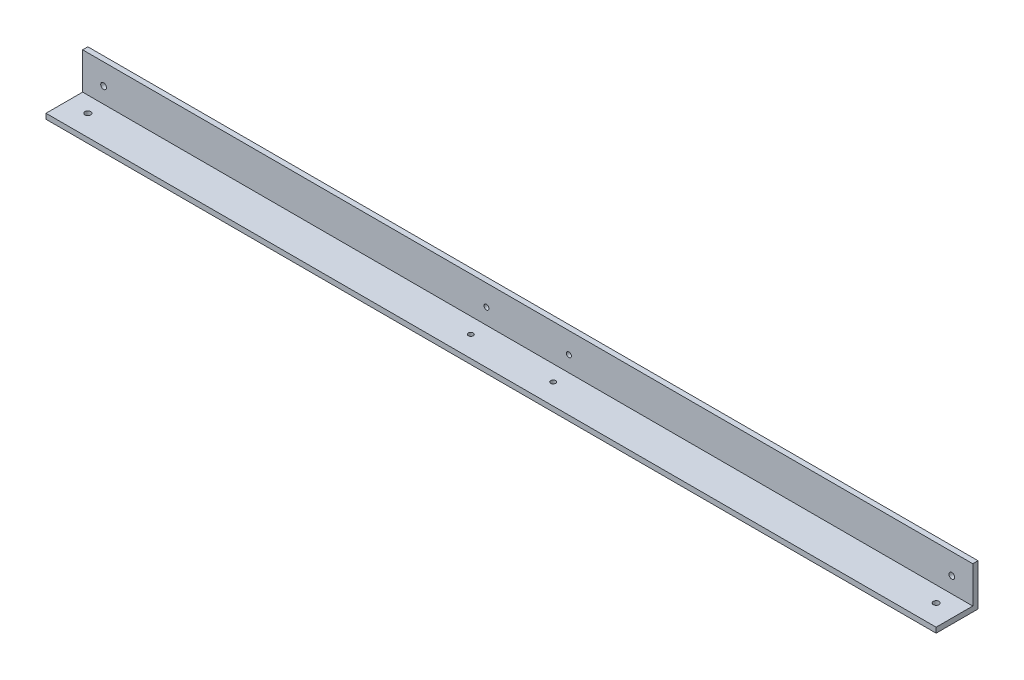
ISO-10303-21;
HEADER;
FILE_DESCRIPTION(('STEP AP214'),'2;1');
FILE_NAME('part.step','',(''),(''),'','','');
FILE_SCHEMA(('AUTOMOTIVE_DESIGN { 1 0 10303 214 1 1 1 1 }'));
ENDSEC;
DATA;
#1=APPLICATION_CONTEXT('core data for automotive mechanical design processes');
#2=APPLICATION_PROTOCOL_DEFINITION('international standard','automotive_design',2000,#1);
#3=PRODUCT_CONTEXT('',#1,'mechanical');
#4=PRODUCT('Part','Part','',(#3));
#5=PRODUCT_RELATED_PRODUCT_CATEGORY('part','',(#4));
#6=PRODUCT_DEFINITION_FORMATION('','',#4);
#7=PRODUCT_DEFINITION_CONTEXT('part definition',#1,'design');
#8=PRODUCT_DEFINITION('design','',#6,#7);
#9=PRODUCT_DEFINITION_SHAPE('','',#8);
#10=(LENGTH_UNIT() NAMED_UNIT(*) SI_UNIT(.MILLI.,.METRE.));
#11=(NAMED_UNIT(*) PLANE_ANGLE_UNIT() SI_UNIT($,.RADIAN.));
#12=(NAMED_UNIT(*) SI_UNIT($,.STERADIAN.) SOLID_ANGLE_UNIT());
#13=UNCERTAINTY_MEASURE_WITH_UNIT(LENGTH_MEASURE(1.E-05),#10,'distance_accuracy_value','');
#14=(GEOMETRIC_REPRESENTATION_CONTEXT(3) GLOBAL_UNCERTAINTY_ASSIGNED_CONTEXT((#13)) GLOBAL_UNIT_ASSIGNED_CONTEXT((#10,
#11,#12)) REPRESENTATION_CONTEXT('',''));
#15=CARTESIAN_POINT('',(0.,0.,0.));
#16=DIRECTION('',(0.,0.,1.));
#17=DIRECTION('',(1.,0.,0.));
#18=AXIS2_PLACEMENT_3D('',#15,#16,#17);
#19=CARTESIAN_POINT('',(-270.,25.4,3.175));
#20=DIRECTION('',(0.,1.,0.));
#21=DIRECTION('',(0.,0.,1.));
#22=AXIS2_PLACEMENT_3D('',#19,#20,#21);
#23=PLANE('',#22);
#24=DIRECTION('',(1.,0.,0.));
#25=VECTOR('',#24,1.);
#26=CARTESIAN_POINT('',(-270.,25.4,3.175));
#27=LINE('',#26,#25);
#28=CARTESIAN_POINT('',(-270.,25.4,3.175));
#29=VERTEX_POINT('',#28);
#30=CARTESIAN_POINT('',(270.,25.4,3.175));
#31=VERTEX_POINT('',#30);
#32=EDGE_CURVE('E38',#29,#31,#27,.T.);
#33=ORIENTED_EDGE('',*,*,#32,.T.);
#34=DIRECTION('',(0.,0.,1.));
#35=VECTOR('',#34,1.);
#36=CARTESIAN_POINT('',(270.,25.4,3.175));
#37=LINE('',#36,#35);
#38=CARTESIAN_POINT('',(270.,25.4,0.));
#39=VERTEX_POINT('',#38);
#40=EDGE_CURVE('E87',#39,#31,#37,.T.);
#41=ORIENTED_EDGE('',*,*,#40,.F.);
#42=DIRECTION('',(1.,0.,0.));
#43=VECTOR('',#42,1.);
#44=CARTESIAN_POINT('',(-270.,25.4,0.));
#45=LINE('',#44,#43);
#46=CARTESIAN_POINT('',(-270.,25.4,0.));
#47=VERTEX_POINT('',#46);
#48=EDGE_CURVE('E11',#47,#39,#45,.T.);
#49=ORIENTED_EDGE('',*,*,#48,.F.);
#50=DIRECTION('',(0.,0.,1.));
#51=VECTOR('',#50,1.);
#52=CARTESIAN_POINT('',(-270.,25.4,3.175));
#53=LINE('',#52,#51);
#54=EDGE_CURVE('E88',#47,#29,#53,.T.);
#55=ORIENTED_EDGE('',*,*,#54,.T.);
#56=EDGE_LOOP('',(#33,#41,#49,#55));
#57=FACE_BOUND('',#56,.T.);
#58=ADVANCED_FACE('F35',(#57),#23,.T.);
#59=CARTESIAN_POINT('',(-270.,25.4,0.));
#60=DIRECTION('',(0.,0.,-1.));
#61=DIRECTION('',(-1.,0.,0.));
#62=AXIS2_PLACEMENT_3D('',#59,#60,#61);
#63=PLANE('',#62);
#64=CARTESIAN_POINT('',(-257.3,12.7,0.));
#65=DIRECTION('',(0.,0.,-1.));
#66=DIRECTION('',(1.,0.,0.));
#67=AXIS2_PLACEMENT_3D('',#64,#65,#66);
#68=CIRCLE('',#67,1.74999999999998);
#69=CARTESIAN_POINT('',(-255.55,12.7,0.));
#70=VERTEX_POINT('',#69);
#71=EDGE_CURVE('E267',#70,#70,#68,.T.);
#72=ORIENTED_EDGE('',*,*,#71,.F.);
#73=EDGE_LOOP('',(#72));
#74=FACE_BOUND('',#73,.T.);
#75=CARTESIAN_POINT('',(257.3,12.7,0.));
#76=DIRECTION('',(0.,0.,-1.));
#77=DIRECTION('',(-1.,0.,0.));
#78=AXIS2_PLACEMENT_3D('',#75,#76,#77);
#79=CIRCLE('',#78,1.74999999999998);
#80=CARTESIAN_POINT('',(255.55,12.7,0.));
#81=VERTEX_POINT('',#80);
#82=EDGE_CURVE('E263',#81,#81,#79,.T.);
#83=ORIENTED_EDGE('',*,*,#82,.F.);
#84=EDGE_LOOP('',(#83));
#85=FACE_BOUND('',#84,.T.);
#86=CARTESIAN_POINT('',(25.,12.7,0.));
#87=DIRECTION('',(0.,0.,-1.));
#88=DIRECTION('',(-1.,0.,0.));
#89=AXIS2_PLACEMENT_3D('',#86,#87,#88);
#90=CIRCLE('',#89,1.5);
#91=CARTESIAN_POINT('',(23.5,12.7,0.));
#92=VERTEX_POINT('',#91);
#93=EDGE_CURVE('E259',#92,#92,#90,.T.);
#94=ORIENTED_EDGE('',*,*,#93,.F.);
#95=EDGE_LOOP('',(#94));
#96=FACE_BOUND('',#95,.T.);
#97=CARTESIAN_POINT('',(-25.,12.7000000000001,0.));
#98=DIRECTION('',(0.,0.,-1.));
#99=DIRECTION('',(-1.,0.,0.));
#100=AXIS2_PLACEMENT_3D('',#97,#98,#99);
#101=CIRCLE('',#100,1.5);
#102=CARTESIAN_POINT('',(-26.5,12.7000000000001,0.));
#103=VERTEX_POINT('',#102);
#104=EDGE_CURVE('E191',#103,#103,#101,.T.);
#105=ORIENTED_EDGE('',*,*,#104,.F.);
#106=EDGE_LOOP('',(#105));
#107=FACE_BOUND('',#106,.T.);
#108=ORIENTED_EDGE('',*,*,#48,.T.);
#109=DIRECTION('',(0.,1.,0.));
#110=VECTOR('',#109,1.);
#111=CARTESIAN_POINT('',(270.,25.4,0.));
#112=LINE('',#111,#110);
#113=CARTESIAN_POINT('',(270.,0.,0.));
#114=VERTEX_POINT('',#113);
#115=EDGE_CURVE('E105',#114,#39,#112,.T.);
#116=ORIENTED_EDGE('',*,*,#115,.F.);
#117=DIRECTION('',(1.,0.,0.));
#118=VECTOR('',#117,1.);
#119=CARTESIAN_POINT('',(-270.,0.,0.));
#120=LINE('',#119,#118);
#121=CARTESIAN_POINT('',(-270.,0.,0.));
#122=VERTEX_POINT('',#121);
#123=EDGE_CURVE('E43',#122,#114,#120,.T.);
#124=ORIENTED_EDGE('',*,*,#123,.F.);
#125=DIRECTION('',(0.,1.,0.));
#126=VECTOR('',#125,1.);
#127=CARTESIAN_POINT('',(-270.,25.4,0.));
#128=LINE('',#127,#126);
#129=EDGE_CURVE('E93',#122,#47,#128,.T.);
#130=ORIENTED_EDGE('',*,*,#129,.T.);
#131=EDGE_LOOP('',(#108,#116,#124,#130));
#132=FACE_BOUND('',#131,.T.);
#133=ADVANCED_FACE('F150',(#74,#85,#96,#107,#132),#63,.T.);
#134=CARTESIAN_POINT('',(-270.,0.,0.));
#135=DIRECTION('',(0.,-1.,0.));
#136=DIRECTION('',(0.,0.,-1.));
#137=AXIS2_PLACEMENT_3D('',#134,#135,#136);
#138=PLANE('',#137);
#139=CARTESIAN_POINT('',(-257.3,0.,12.7));
#140=DIRECTION('',(0.,-1.,0.));
#141=DIRECTION('',(0.,0.,1.));
#142=AXIS2_PLACEMENT_3D('',#139,#140,#141);
#143=CIRCLE('',#142,1.74999999999998);
#144=CARTESIAN_POINT('',(-257.3,0.,14.45));
#145=VERTEX_POINT('',#144);
#146=EDGE_CURVE('E190',#145,#145,#143,.T.);
#147=ORIENTED_EDGE('',*,*,#146,.F.);
#148=EDGE_LOOP('',(#147));
#149=FACE_BOUND('',#148,.T.);
#150=CARTESIAN_POINT('',(257.3,0.,12.7));
#151=DIRECTION('',(0.,-1.,0.));
#152=DIRECTION('',(0.,0.,-1.));
#153=AXIS2_PLACEMENT_3D('',#150,#151,#152);
#154=CIRCLE('',#153,1.74999999999998);
#155=CARTESIAN_POINT('',(257.3,0.,10.95));
#156=VERTEX_POINT('',#155);
#157=EDGE_CURVE('E207',#156,#156,#154,.T.);
#158=ORIENTED_EDGE('',*,*,#157,.F.);
#159=EDGE_LOOP('',(#158));
#160=FACE_BOUND('',#159,.T.);
#161=CARTESIAN_POINT('',(-25.,0.,12.6999999999999));
#162=DIRECTION('',(0.,-1.,0.));
#163=DIRECTION('',(0.,0.,-1.));
#164=AXIS2_PLACEMENT_3D('',#161,#162,#163);
#165=CIRCLE('',#164,1.5);
#166=CARTESIAN_POINT('',(-25.,0.,11.1999999999999));
#167=VERTEX_POINT('',#166);
#168=EDGE_CURVE('E200',#167,#167,#165,.T.);
#169=ORIENTED_EDGE('',*,*,#168,.F.);
#170=EDGE_LOOP('',(#169));
#171=FACE_BOUND('',#170,.T.);
#172=CARTESIAN_POINT('',(25.,0.,12.7));
#173=DIRECTION('',(0.,-1.,0.));
#174=DIRECTION('',(0.,0.,-1.));
#175=AXIS2_PLACEMENT_3D('',#172,#173,#174);
#176=CIRCLE('',#175,1.5);
#177=CARTESIAN_POINT('',(25.,0.,11.1999999999999));
#178=VERTEX_POINT('',#177);
#179=EDGE_CURVE('E109',#178,#178,#176,.T.);
#180=ORIENTED_EDGE('',*,*,#179,.F.);
#181=EDGE_LOOP('',(#180));
#182=FACE_BOUND('',#181,.T.);
#183=ORIENTED_EDGE('',*,*,#123,.T.);
#184=DIRECTION('',(0.,0.,-1.));
#185=VECTOR('',#184,1.);
#186=CARTESIAN_POINT('',(270.,0.,0.));
#187=LINE('',#186,#185);
#188=CARTESIAN_POINT('',(270.,0.,25.4));
#189=VERTEX_POINT('',#188);
#190=EDGE_CURVE('E117',#189,#114,#187,.T.);
#191=ORIENTED_EDGE('',*,*,#190,.F.);
#192=DIRECTION('',(1.,0.,0.));
#193=VECTOR('',#192,1.);
#194=CARTESIAN_POINT('',(-270.,0.,25.4));
#195=LINE('',#194,#193);
#196=CARTESIAN_POINT('',(-270.,0.,25.4));
#197=VERTEX_POINT('',#196);
#198=EDGE_CURVE('E133',#197,#189,#195,.T.);
#199=ORIENTED_EDGE('',*,*,#198,.F.);
#200=DIRECTION('',(0.,0.,-1.));
#201=VECTOR('',#200,1.);
#202=CARTESIAN_POINT('',(-270.,0.,0.));
#203=LINE('',#202,#201);
#204=EDGE_CURVE('E129',#197,#122,#203,.T.);
#205=ORIENTED_EDGE('',*,*,#204,.T.);
#206=EDGE_LOOP('',(#183,#191,#199,#205));
#207=FACE_BOUND('',#206,.T.);
#208=ADVANCED_FACE('F146',(#149,#160,#171,#182,#207),#138,.T.);
#209=CARTESIAN_POINT('',(-270.,0.,25.4));
#210=DIRECTION('',(0.,0.,1.));
#211=DIRECTION('',(1.,0.,0.));
#212=AXIS2_PLACEMENT_3D('',#209,#210,#211);
#213=PLANE('',#212);
#214=ORIENTED_EDGE('',*,*,#198,.T.);
#215=DIRECTION('',(0.,-1.,0.));
#216=VECTOR('',#215,1.);
#217=CARTESIAN_POINT('',(270.,0.,25.4));
#218=LINE('',#217,#216);
#219=CARTESIAN_POINT('',(270.,3.175,25.4));
#220=VERTEX_POINT('',#219);
#221=EDGE_CURVE('E114',#220,#189,#218,.T.);
#222=ORIENTED_EDGE('',*,*,#221,.F.);
#223=DIRECTION('',(1.,0.,0.));
#224=VECTOR('',#223,1.);
#225=CARTESIAN_POINT('',(-270.,3.175,25.4));
#226=LINE('',#225,#224);
#227=CARTESIAN_POINT('',(-270.,3.175,25.4));
#228=VERTEX_POINT('',#227);
#229=EDGE_CURVE('E135',#228,#220,#226,.T.);
#230=ORIENTED_EDGE('',*,*,#229,.F.);
#231=DIRECTION('',(0.,-1.,0.));
#232=VECTOR('',#231,1.);
#233=CARTESIAN_POINT('',(-270.,0.,25.4));
#234=LINE('',#233,#232);
#235=EDGE_CURVE('E126',#228,#197,#234,.T.);
#236=ORIENTED_EDGE('',*,*,#235,.T.);
#237=EDGE_LOOP('',(#214,#222,#230,#236));
#238=FACE_BOUND('',#237,.T.);
#239=ADVANCED_FACE('F143',(#238),#213,.T.);
#240=CARTESIAN_POINT('',(-270.,3.175,25.4));
#241=DIRECTION('',(0.,1.,0.));
#242=DIRECTION('',(0.,0.,1.));
#243=AXIS2_PLACEMENT_3D('',#240,#241,#242);
#244=PLANE('',#243);
#245=CARTESIAN_POINT('',(-257.3,3.175,12.7));
#246=DIRECTION('',(0.,1.,0.));
#247=DIRECTION('',(0.,0.,1.));
#248=AXIS2_PLACEMENT_3D('',#245,#246,#247);
#249=CIRCLE('',#248,1.74999999999998);
#250=CARTESIAN_POINT('',(-257.3,3.175,14.45));
#251=VERTEX_POINT('',#250);
#252=EDGE_CURVE('E194',#251,#251,#249,.F.);
#253=ORIENTED_EDGE('',*,*,#252,.T.);
#254=EDGE_LOOP('',(#253));
#255=FACE_BOUND('',#254,.T.);
#256=CARTESIAN_POINT('',(257.3,3.175,12.7));
#257=DIRECTION('',(0.,1.,0.));
#258=DIRECTION('',(0.,0.,1.));
#259=AXIS2_PLACEMENT_3D('',#256,#257,#258);
#260=CIRCLE('',#259,1.74999999999998);
#261=CARTESIAN_POINT('',(257.3,3.175,14.45));
#262=VERTEX_POINT('',#261);
#263=EDGE_CURVE('E204',#262,#262,#260,.F.);
#264=ORIENTED_EDGE('',*,*,#263,.T.);
#265=EDGE_LOOP('',(#264));
#266=FACE_BOUND('',#265,.T.);
#267=CARTESIAN_POINT('',(-25.,3.175,12.6999999999999));
#268=DIRECTION('',(0.,1.,0.));
#269=DIRECTION('',(0.,0.,1.));
#270=AXIS2_PLACEMENT_3D('',#267,#268,#269);
#271=CIRCLE('',#270,1.5);
#272=CARTESIAN_POINT('',(-25.,3.175,14.1999999999999));
#273=VERTEX_POINT('',#272);
#274=EDGE_CURVE('E203',#273,#273,#271,.F.);
#275=ORIENTED_EDGE('',*,*,#274,.T.);
#276=EDGE_LOOP('',(#275));
#277=FACE_BOUND('',#276,.T.);
#278=CARTESIAN_POINT('',(25.,3.175,12.7));
#279=DIRECTION('',(0.,1.,0.));
#280=DIRECTION('',(0.,0.,1.));
#281=AXIS2_PLACEMENT_3D('',#278,#279,#280);
#282=CIRCLE('',#281,1.5);
#283=CARTESIAN_POINT('',(25.,3.175,14.2));
#284=VERTEX_POINT('',#283);
#285=EDGE_CURVE('E106',#284,#284,#282,.F.);
#286=ORIENTED_EDGE('',*,*,#285,.T.);
#287=EDGE_LOOP('',(#286));
#288=FACE_BOUND('',#287,.T.);
#289=ORIENTED_EDGE('',*,*,#229,.T.);
#290=DIRECTION('',(0.,0.,1.));
#291=VECTOR('',#290,1.);
#292=CARTESIAN_POINT('',(270.,3.175,25.4));
#293=LINE('',#292,#291);
#294=CARTESIAN_POINT('',(270.,3.175,3.175));
#295=VERTEX_POINT('',#294);
#296=EDGE_CURVE('E100',#295,#220,#293,.T.);
#297=ORIENTED_EDGE('',*,*,#296,.F.);
#298=DIRECTION('',(1.,0.,0.));
#299=VECTOR('',#298,1.);
#300=CARTESIAN_POINT('',(-270.,3.175,3.175));
#301=LINE('',#300,#299);
#302=CARTESIAN_POINT('',(-270.,3.175,3.175));
#303=VERTEX_POINT('',#302);
#304=EDGE_CURVE('E92',#303,#295,#301,.T.);
#305=ORIENTED_EDGE('',*,*,#304,.F.);
#306=DIRECTION('',(0.,0.,1.));
#307=VECTOR('',#306,1.);
#308=CARTESIAN_POINT('',(-270.,3.175,25.4));
#309=LINE('',#308,#307);
#310=EDGE_CURVE('E123',#303,#228,#309,.T.);
#311=ORIENTED_EDGE('',*,*,#310,.T.);
#312=EDGE_LOOP('',(#289,#297,#305,#311));
#313=FACE_BOUND('',#312,.T.);
#314=ADVANCED_FACE('F137',(#255,#266,#277,#288,#313),#244,.T.);
#315=CARTESIAN_POINT('',(-270.,3.175,3.175));
#316=DIRECTION('',(0.,0.,1.));
#317=DIRECTION('',(0.,-1.,0.));
#318=AXIS2_PLACEMENT_3D('',#315,#316,#317);
#319=PLANE('',#318);
#320=CARTESIAN_POINT('',(-257.3,12.7,3.175));
#321=DIRECTION('',(0.,0.,1.));
#322=DIRECTION('',(0.,-1.,0.));
#323=AXIS2_PLACEMENT_3D('',#320,#321,#322);
#324=CIRCLE('',#323,1.74999999999998);
#325=CARTESIAN_POINT('',(-257.3,10.95,3.175));
#326=VERTEX_POINT('',#325);
#327=EDGE_CURVE('E177',#326,#326,#324,.F.);
#328=ORIENTED_EDGE('',*,*,#327,.T.);
#329=EDGE_LOOP('',(#328));
#330=FACE_BOUND('',#329,.T.);
#331=CARTESIAN_POINT('',(257.3,12.7,3.175));
#332=DIRECTION('',(0.,0.,1.));
#333=DIRECTION('',(0.,-1.,0.));
#334=AXIS2_PLACEMENT_3D('',#331,#332,#333);
#335=CIRCLE('',#334,1.74999999999998);
#336=CARTESIAN_POINT('',(257.3,10.95,3.175));
#337=VERTEX_POINT('',#336);
#338=EDGE_CURVE('E181',#337,#337,#335,.F.);
#339=ORIENTED_EDGE('',*,*,#338,.T.);
#340=EDGE_LOOP('',(#339));
#341=FACE_BOUND('',#340,.T.);
#342=CARTESIAN_POINT('',(25.,12.7,3.175));
#343=DIRECTION('',(0.,0.,1.));
#344=DIRECTION('',(0.,-1.,0.));
#345=AXIS2_PLACEMENT_3D('',#342,#343,#344);
#346=CIRCLE('',#345,1.5);
#347=CARTESIAN_POINT('',(25.,11.2,3.175));
#348=VERTEX_POINT('',#347);
#349=EDGE_CURVE('E185',#348,#348,#346,.F.);
#350=ORIENTED_EDGE('',*,*,#349,.T.);
#351=EDGE_LOOP('',(#350));
#352=FACE_BOUND('',#351,.T.);
#353=CARTESIAN_POINT('',(-25.,12.7000000000001,3.175));
#354=DIRECTION('',(0.,0.,1.));
#355=DIRECTION('',(0.,-1.,0.));
#356=AXIS2_PLACEMENT_3D('',#353,#354,#355);
#357=CIRCLE('',#356,1.5);
#358=CARTESIAN_POINT('',(-25.,11.2000000000001,3.175));
#359=VERTEX_POINT('',#358);
#360=EDGE_CURVE('E188',#359,#359,#357,.F.);
#361=ORIENTED_EDGE('',*,*,#360,.T.);
#362=EDGE_LOOP('',(#361));
#363=FACE_BOUND('',#362,.T.);
#364=ORIENTED_EDGE('',*,*,#304,.T.);
#365=DIRECTION('',(0.,-1.,0.));
#366=VECTOR('',#365,1.);
#367=CARTESIAN_POINT('',(270.,3.175,3.175));
#368=LINE('',#367,#366);
#369=EDGE_CURVE('E95',#31,#295,#368,.T.);
#370=ORIENTED_EDGE('',*,*,#369,.F.);
#371=ORIENTED_EDGE('',*,*,#32,.F.);
#372=DIRECTION('',(0.,-1.,0.));
#373=VECTOR('',#372,1.);
#374=CARTESIAN_POINT('',(-270.,3.175,3.175));
#375=LINE('',#374,#373);
#376=EDGE_CURVE('E121',#29,#303,#375,.T.);
#377=ORIENTED_EDGE('',*,*,#376,.T.);
#378=EDGE_LOOP('',(#364,#370,#371,#377));
#379=FACE_BOUND('',#378,.T.);
#380=ADVANCED_FACE('F96',(#330,#341,#352,#363,#379),#319,.T.);
#381=CARTESIAN_POINT('',(-270.,0.,0.));
#382=DIRECTION('',(-1.,0.,0.));
#383=DIRECTION('',(0.,0.,1.));
#384=AXIS2_PLACEMENT_3D('',#381,#382,#383);
#385=PLANE('',#384);
#386=ORIENTED_EDGE('',*,*,#54,.F.);
#387=ORIENTED_EDGE('',*,*,#129,.F.);
#388=ORIENTED_EDGE('',*,*,#204,.F.);
#389=ORIENTED_EDGE('',*,*,#235,.F.);
#390=ORIENTED_EDGE('',*,*,#310,.F.);
#391=ORIENTED_EDGE('',*,*,#376,.F.);
#392=EDGE_LOOP('',(#386,#387,#388,#389,#390,#391));
#393=FACE_BOUND('',#392,.T.);
#394=ADVANCED_FACE('F149',(#393),#385,.T.);
#395=CARTESIAN_POINT('',(270.,0.,0.));
#396=DIRECTION('',(-1.,0.,0.));
#397=DIRECTION('',(0.,0.,1.));
#398=AXIS2_PLACEMENT_3D('',#395,#396,#397);
#399=PLANE('',#398);
#400=ORIENTED_EDGE('',*,*,#40,.T.);
#401=ORIENTED_EDGE('',*,*,#369,.T.);
#402=ORIENTED_EDGE('',*,*,#296,.T.);
#403=ORIENTED_EDGE('',*,*,#221,.T.);
#404=ORIENTED_EDGE('',*,*,#190,.T.);
#405=ORIENTED_EDGE('',*,*,#115,.T.);
#406=EDGE_LOOP('',(#400,#401,#402,#403,#404,#405));
#407=FACE_BOUND('',#406,.T.);
#408=ADVANCED_FACE('F103',(#407),#399,.F.);
#409=CARTESIAN_POINT('',(25.,8.12474746830576,12.7));
#410=DIRECTION('',(0.,-1.,0.));
#411=DIRECTION('',(0.,0.,-1.));
#412=AXIS2_PLACEMENT_3D('',#409,#410,#411);
#413=CYLINDRICAL_SURFACE('',#412,1.5);
#414=ORIENTED_EDGE('',*,*,#179,.T.);
#415=EDGE_LOOP('',(#414));
#416=FACE_BOUND('',#415,.T.);
#417=ORIENTED_EDGE('',*,*,#285,.F.);
#418=EDGE_LOOP('',(#417));
#419=FACE_BOUND('',#418,.T.);
#420=ADVANCED_FACE('F216',(#416,#419),#413,.F.);
#421=CARTESIAN_POINT('',(-25.,8.12474746830576,12.6999999999999));
#422=DIRECTION('',(0.,-1.,0.));
#423=DIRECTION('',(0.,0.,-1.));
#424=AXIS2_PLACEMENT_3D('',#421,#422,#423);
#425=CYLINDRICAL_SURFACE('',#424,1.5);
#426=ORIENTED_EDGE('',*,*,#168,.T.);
#427=EDGE_LOOP('',(#426));
#428=FACE_BOUND('',#427,.T.);
#429=ORIENTED_EDGE('',*,*,#274,.F.);
#430=EDGE_LOOP('',(#429));
#431=FACE_BOUND('',#430,.T.);
#432=ADVANCED_FACE('F220',(#428,#431),#425,.F.);
#433=CARTESIAN_POINT('',(257.3,8.12474746830576,12.7));
#434=DIRECTION('',(0.,-1.,0.));
#435=DIRECTION('',(0.,0.,-1.));
#436=AXIS2_PLACEMENT_3D('',#433,#434,#435);
#437=CYLINDRICAL_SURFACE('',#436,1.74999999999998);
#438=ORIENTED_EDGE('',*,*,#157,.T.);
#439=EDGE_LOOP('',(#438));
#440=FACE_BOUND('',#439,.T.);
#441=ORIENTED_EDGE('',*,*,#263,.F.);
#442=EDGE_LOOP('',(#441));
#443=FACE_BOUND('',#442,.T.);
#444=ADVANCED_FACE('F228',(#440,#443),#437,.F.);
#445=CARTESIAN_POINT('',(-257.3,8.12474746830576,12.7));
#446=DIRECTION('',(0.,-1.,0.));
#447=DIRECTION('',(0.,0.,-1.));
#448=AXIS2_PLACEMENT_3D('',#445,#446,#447);
#449=CYLINDRICAL_SURFACE('',#448,1.74999999999998);
#450=ORIENTED_EDGE('',*,*,#146,.T.);
#451=EDGE_LOOP('',(#450));
#452=FACE_BOUND('',#451,.T.);
#453=ORIENTED_EDGE('',*,*,#252,.F.);
#454=EDGE_LOOP('',(#453));
#455=FACE_BOUND('',#454,.T.);
#456=ADVANCED_FACE('F232',(#452,#455),#449,.F.);
#457=CARTESIAN_POINT('',(-25.,12.7000000000001,8.12474746830577));
#458=DIRECTION('',(0.,0.,-1.));
#459=DIRECTION('',(-1.,0.,0.));
#460=AXIS2_PLACEMENT_3D('',#457,#458,#459);
#461=CYLINDRICAL_SURFACE('',#460,1.5);
#462=ORIENTED_EDGE('',*,*,#104,.T.);
#463=EDGE_LOOP('',(#462));
#464=FACE_BOUND('',#463,.T.);
#465=ORIENTED_EDGE('',*,*,#360,.F.);
#466=EDGE_LOOP('',(#465));
#467=FACE_BOUND('',#466,.T.);
#468=ADVANCED_FACE('F235',(#464,#467),#461,.F.);
#469=CARTESIAN_POINT('',(25.,12.7,8.12474746830577));
#470=DIRECTION('',(0.,0.,-1.));
#471=DIRECTION('',(-1.,0.,0.));
#472=AXIS2_PLACEMENT_3D('',#469,#470,#471);
#473=CYLINDRICAL_SURFACE('',#472,1.5);
#474=ORIENTED_EDGE('',*,*,#93,.T.);
#475=EDGE_LOOP('',(#474));
#476=FACE_BOUND('',#475,.T.);
#477=ORIENTED_EDGE('',*,*,#349,.F.);
#478=EDGE_LOOP('',(#477));
#479=FACE_BOUND('',#478,.T.);
#480=ADVANCED_FACE('F242',(#476,#479),#473,.F.);
#481=CARTESIAN_POINT('',(257.3,12.7,8.12474746830577));
#482=DIRECTION('',(0.,0.,-1.));
#483=DIRECTION('',(-1.,0.,0.));
#484=AXIS2_PLACEMENT_3D('',#481,#482,#483);
#485=CYLINDRICAL_SURFACE('',#484,1.74999999999998);
#486=ORIENTED_EDGE('',*,*,#82,.T.);
#487=EDGE_LOOP('',(#486));
#488=FACE_BOUND('',#487,.T.);
#489=ORIENTED_EDGE('',*,*,#338,.F.);
#490=EDGE_LOOP('',(#489));
#491=FACE_BOUND('',#490,.T.);
#492=ADVANCED_FACE('F247',(#488,#491),#485,.F.);
#493=CARTESIAN_POINT('',(-257.3,12.7,8.12474746830577));
#494=DIRECTION('',(0.,0.,-1.));
#495=DIRECTION('',(-1.,0.,0.));
#496=AXIS2_PLACEMENT_3D('',#493,#494,#495);
#497=CYLINDRICAL_SURFACE('',#496,1.74999999999998);
#498=ORIENTED_EDGE('',*,*,#71,.T.);
#499=EDGE_LOOP('',(#498));
#500=FACE_BOUND('',#499,.T.);
#501=ORIENTED_EDGE('',*,*,#327,.F.);
#502=EDGE_LOOP('',(#501));
#503=FACE_BOUND('',#502,.T.);
#504=ADVANCED_FACE('F244',(#500,#503),#497,.F.);
#505=CLOSED_SHELL('',(#58,#133,#208,#239,#314,#380,#394,#408,#420,#432,#444,#456,#468,#480,#492,#504));
#506=MANIFOLD_SOLID_BREP('B2',#505);
#507=ADVANCED_BREP_SHAPE_REPRESENTATION('',(#18,#506),#14);
#508=SHAPE_DEFINITION_REPRESENTATION(#9,#507);
ENDSEC;
END-ISO-10303-21;
